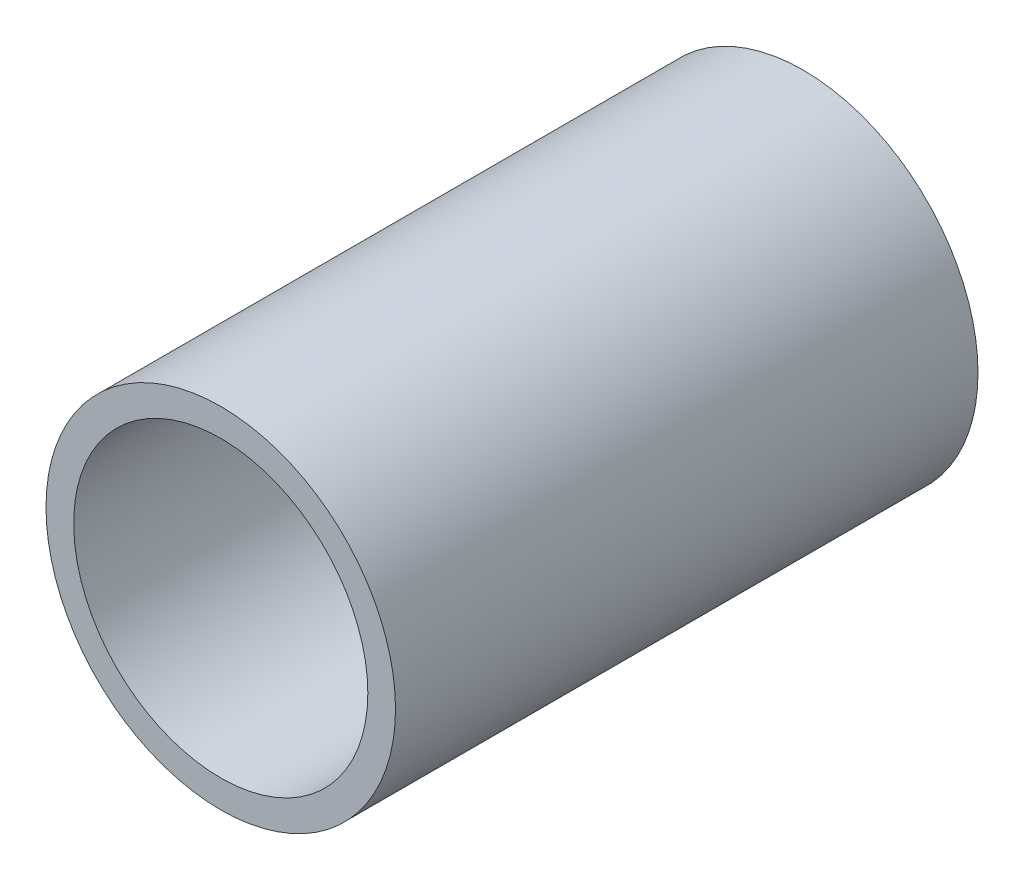
ISO-10303-21;
HEADER;
FILE_DESCRIPTION(('STEP AP214'),'2;1');
FILE_NAME('part.step','',(''),(''),'','','');
FILE_SCHEMA(('AUTOMOTIVE_DESIGN { 1 0 10303 214 1 1 1 1 }'));
ENDSEC;
DATA;
#1=APPLICATION_CONTEXT('core data for automotive mechanical design processes');
#2=APPLICATION_PROTOCOL_DEFINITION('international standard','automotive_design',2000,#1);
#3=PRODUCT_CONTEXT('',#1,'mechanical');
#4=PRODUCT('Part','Part','',(#3));
#5=PRODUCT_RELATED_PRODUCT_CATEGORY('part','',(#4));
#6=PRODUCT_DEFINITION_FORMATION('','',#4);
#7=PRODUCT_DEFINITION_CONTEXT('part definition',#1,'design');
#8=PRODUCT_DEFINITION('design','',#6,#7);
#9=PRODUCT_DEFINITION_SHAPE('','',#8);
#10=(LENGTH_UNIT() NAMED_UNIT(*) SI_UNIT(.MILLI.,.METRE.));
#11=(NAMED_UNIT(*) PLANE_ANGLE_UNIT() SI_UNIT($,.RADIAN.));
#12=(NAMED_UNIT(*) SI_UNIT($,.STERADIAN.) SOLID_ANGLE_UNIT());
#13=UNCERTAINTY_MEASURE_WITH_UNIT(LENGTH_MEASURE(1.E-05),#10,'distance_accuracy_value','');
#14=(GEOMETRIC_REPRESENTATION_CONTEXT(3) GLOBAL_UNCERTAINTY_ASSIGNED_CONTEXT((#13)) GLOBAL_UNIT_ASSIGNED_CONTEXT((#10,
#11,#12)) REPRESENTATION_CONTEXT('',''));
#15=CARTESIAN_POINT('',(0.,0.,0.));
#16=DIRECTION('',(0.,0.,1.));
#17=DIRECTION('',(1.,0.,0.));
#18=AXIS2_PLACEMENT_3D('',#15,#16,#17);
#19=CARTESIAN_POINT('',(0.,0.,31.75));
#20=DIRECTION('',(0.,0.,-1.));
#21=DIRECTION('',(-1.,0.,0.));
#22=AXIS2_PLACEMENT_3D('',#19,#20,#21);
#23=CYLINDRICAL_SURFACE('',#22,9.525);
#24=CARTESIAN_POINT('',(0.,0.,31.75));
#25=DIRECTION('',(0.,0.,1.));
#26=DIRECTION('',(1.,0.,0.));
#27=AXIS2_PLACEMENT_3D('',#24,#25,#26);
#28=CIRCLE('',#27,9.525);
#29=CARTESIAN_POINT('',(9.525,0.,31.75));
#30=VERTEX_POINT('',#29);
#31=EDGE_CURVE('E12',#30,#30,#28,.T.);
#32=ORIENTED_EDGE('',*,*,#31,.F.);
#33=EDGE_LOOP('',(#32));
#34=FACE_BOUND('',#33,.T.);
#35=CARTESIAN_POINT('',(0.,0.,0.));
#36=DIRECTION('',(0.,0.,1.));
#37=DIRECTION('',(1.,0.,0.));
#38=AXIS2_PLACEMENT_3D('',#35,#36,#37);
#39=CIRCLE('',#38,9.525);
#40=CARTESIAN_POINT('',(9.525,0.,0.));
#41=VERTEX_POINT('',#40);
#42=EDGE_CURVE('E50',#41,#41,#39,.T.);
#43=ORIENTED_EDGE('',*,*,#42,.T.);
#44=EDGE_LOOP('',(#43));
#45=FACE_BOUND('',#44,.T.);
#46=ADVANCED_FACE('F43',(#34,#45),#23,.T.);
#47=CARTESIAN_POINT('',(0.,0.,31.75));
#48=DIRECTION('',(0.,0.,1.));
#49=DIRECTION('',(1.,0.,0.));
#50=AXIS2_PLACEMENT_3D('',#47,#48,#49);
#51=PLANE('',#50);
#52=CARTESIAN_POINT('',(0.,0.,31.75));
#53=DIRECTION('',(0.,0.,1.));
#54=DIRECTION('',(1.,0.,0.));
#55=AXIS2_PLACEMENT_3D('',#52,#53,#54);
#56=CIRCLE('',#55,8.016875);
#57=CARTESIAN_POINT('',(8.016875,0.,31.75));
#58=VERTEX_POINT('',#57);
#59=EDGE_CURVE('E59',#58,#58,#56,.T.);
#60=ORIENTED_EDGE('',*,*,#59,.F.);
#61=EDGE_LOOP('',(#60));
#62=FACE_BOUND('',#61,.T.);
#63=ORIENTED_EDGE('',*,*,#31,.T.);
#64=EDGE_LOOP('',(#63));
#65=FACE_BOUND('',#64,.T.);
#66=ADVANCED_FACE('F75',(#62,#65),#51,.T.);
#67=CARTESIAN_POINT('',(0.,0.,0.));
#68=DIRECTION('',(0.,0.,1.));
#69=DIRECTION('',(1.,0.,0.));
#70=AXIS2_PLACEMENT_3D('',#67,#68,#69);
#71=PLANE('',#70);
#72=CARTESIAN_POINT('',(0.,0.,0.));
#73=DIRECTION('',(0.,0.,-1.));
#74=DIRECTION('',(-1.,0.,0.));
#75=AXIS2_PLACEMENT_3D('',#72,#73,#74);
#76=CIRCLE('',#75,6.4389);
#77=CARTESIAN_POINT('',(-6.4389,0.,0.));
#78=VERTEX_POINT('',#77);
#79=EDGE_CURVE('E65',#78,#78,#76,.T.);
#80=ORIENTED_EDGE('',*,*,#79,.F.);
#81=EDGE_LOOP('',(#80));
#82=FACE_BOUND('',#81,.T.);
#83=ORIENTED_EDGE('',*,*,#42,.F.);
#84=EDGE_LOOP('',(#83));
#85=FACE_BOUND('',#84,.T.);
#86=ADVANCED_FACE('F71',(#82,#85),#71,.F.);
#87=CARTESIAN_POINT('',(0.,0.,6.35));
#88=DIRECTION('',(0.,0.,1.));
#89=DIRECTION('',(1.,0.,0.));
#90=AXIS2_PLACEMENT_3D('',#87,#88,#89);
#91=CONICAL_SURFACE('',#90,8.01687499999999,1.02974425867665);
#92=CARTESIAN_POINT('',(0.,0.,3.56280286803233));
#93=DIRECTION('',(0.,0.,1.));
#94=DIRECTION('',(1.,0.,0.));
#95=AXIS2_PLACEMENT_3D('',#92,#93,#94);
#96=CIRCLE('',#95,3.3782);
#97=CARTESIAN_POINT('',(3.3782,0.,3.56280286803233));
#98=VERTEX_POINT('',#97);
#99=EDGE_CURVE('E46',#98,#98,#96,.F.);
#100=ORIENTED_EDGE('',*,*,#99,.T.);
#101=EDGE_LOOP('',(#100));
#102=FACE_BOUND('',#101,.T.);
#103=CARTESIAN_POINT('',(0.,0.,6.35));
#104=DIRECTION('',(0.,0.,1.));
#105=DIRECTION('',(1.,0.,0.));
#106=AXIS2_PLACEMENT_3D('',#103,#104,#105);
#107=CIRCLE('',#106,8.01687499999999);
#108=CARTESIAN_POINT('',(8.01687499999999,0.,6.35));
#109=VERTEX_POINT('',#108);
#110=EDGE_CURVE('E55',#109,#109,#107,.T.);
#111=ORIENTED_EDGE('',*,*,#110,.T.);
#112=EDGE_LOOP('',(#111));
#113=FACE_BOUND('',#112,.T.);
#114=ADVANCED_FACE('F74',(#102,#113),#91,.F.);
#115=CARTESIAN_POINT('',(0.,0.,31.75));
#116=DIRECTION('',(0.,0.,1.));
#117=DIRECTION('',(1.,0.,0.));
#118=AXIS2_PLACEMENT_3D('',#115,#116,#117);
#119=CYLINDRICAL_SURFACE('',#118,8.016875);
#120=ORIENTED_EDGE('',*,*,#110,.F.);
#121=EDGE_LOOP('',(#120));
#122=FACE_BOUND('',#121,.T.);
#123=ORIENTED_EDGE('',*,*,#59,.T.);
#124=EDGE_LOOP('',(#123));
#125=FACE_BOUND('',#124,.T.);
#126=ADVANCED_FACE('F91',(#122,#125),#119,.F.);
#127=CARTESIAN_POINT('',(0.,0.,0.));
#128=DIRECTION('',(0.,0.,-1.));
#129=DIRECTION('',(-1.,0.,0.));
#130=AXIS2_PLACEMENT_3D('',#127,#128,#129);
#131=CYLINDRICAL_SURFACE('',#130,3.3782);
#132=CARTESIAN_POINT('',(0.,0.,2.5682322411443));
#133=DIRECTION('',(0.,0.,-1.));
#134=DIRECTION('',(-1.,0.,0.));
#135=AXIS2_PLACEMENT_3D('',#132,#133,#134);
#136=CIRCLE('',#135,3.3782);
#137=CARTESIAN_POINT('',(-3.3782,0.,2.5682322411443));
#138=VERTEX_POINT('',#137);
#139=EDGE_CURVE('E62',#138,#138,#136,.T.);
#140=ORIENTED_EDGE('',*,*,#139,.T.);
#141=EDGE_LOOP('',(#140));
#142=FACE_BOUND('',#141,.T.);
#143=ORIENTED_EDGE('',*,*,#99,.F.);
#144=EDGE_LOOP('',(#143));
#145=FACE_BOUND('',#144,.T.);
#146=ADVANCED_FACE('F95',(#142,#145),#131,.F.);
#147=CARTESIAN_POINT('',(0.,0.,0.));
#148=DIRECTION('',(0.,0.,-1.));
#149=DIRECTION('',(-1.,0.,0.));
#150=AXIS2_PLACEMENT_3D('',#147,#148,#149);
#151=CONICAL_SURFACE('',#150,6.4389,0.872664625997165);
#152=ORIENTED_EDGE('',*,*,#139,.F.);
#153=EDGE_LOOP('',(#152));
#154=FACE_BOUND('',#153,.T.);
#155=ORIENTED_EDGE('',*,*,#79,.T.);
#156=EDGE_LOOP('',(#155));
#157=FACE_BOUND('',#156,.T.);
#158=ADVANCED_FACE('F69',(#154,#157),#151,.F.);
#159=CLOSED_SHELL('',(#46,#66,#86,#114,#126,#146,#158));
#160=MANIFOLD_SOLID_BREP('B2',#159);
#161=ADVANCED_BREP_SHAPE_REPRESENTATION('',(#18,#160),#14);
#162=SHAPE_DEFINITION_REPRESENTATION(#9,#161);
ENDSEC;
END-ISO-10303-21;
